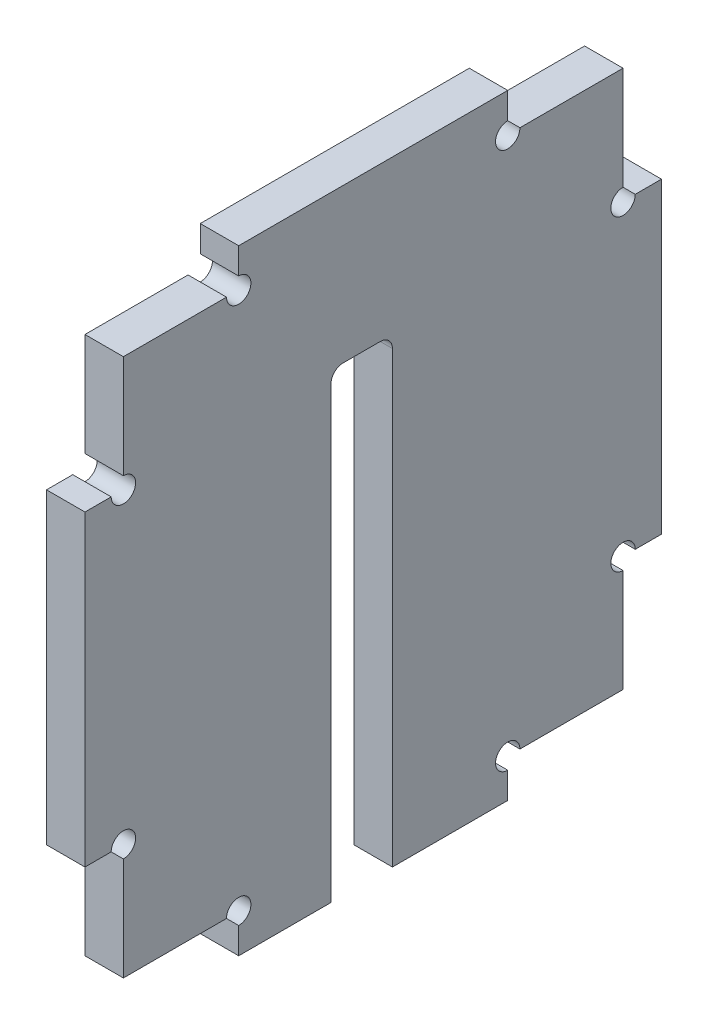
ISO-10303-21;
HEADER;
FILE_DESCRIPTION(('STEP AP214'),'2;1');
FILE_NAME('part.step','',(''),(''),'','','');
FILE_SCHEMA(('AUTOMOTIVE_DESIGN { 1 0 10303 214 1 1 1 1 }'));
ENDSEC;
DATA;
#1=APPLICATION_CONTEXT('core data for automotive mechanical design processes');
#2=APPLICATION_PROTOCOL_DEFINITION('international standard','automotive_design',2000,#1);
#3=PRODUCT_CONTEXT('',#1,'mechanical');
#4=PRODUCT('Part','Part','',(#3));
#5=PRODUCT_RELATED_PRODUCT_CATEGORY('part','',(#4));
#6=PRODUCT_DEFINITION_FORMATION('','',#4);
#7=PRODUCT_DEFINITION_CONTEXT('part definition',#1,'design');
#8=PRODUCT_DEFINITION('design','',#6,#7);
#9=PRODUCT_DEFINITION_SHAPE('','',#8);
#10=(LENGTH_UNIT() NAMED_UNIT(*) SI_UNIT(.MILLI.,.METRE.));
#11=(NAMED_UNIT(*) PLANE_ANGLE_UNIT() SI_UNIT($,.RADIAN.));
#12=(NAMED_UNIT(*) SI_UNIT($,.STERADIAN.) SOLID_ANGLE_UNIT());
#13=UNCERTAINTY_MEASURE_WITH_UNIT(LENGTH_MEASURE(1.E-05),#10,'distance_accuracy_value','');
#14=(GEOMETRIC_REPRESENTATION_CONTEXT(3) GLOBAL_UNCERTAINTY_ASSIGNED_CONTEXT((#13)) GLOBAL_UNIT_ASSIGNED_CONTEXT((#10,
#11,#12)) REPRESENTATION_CONTEXT('',''));
#15=CARTESIAN_POINT('',(0.,0.,0.));
#16=DIRECTION('',(0.,0.,1.));
#17=DIRECTION('',(1.,0.,0.));
#18=AXIS2_PLACEMENT_3D('',#15,#16,#17);
#19=CARTESIAN_POINT('',(5.,-40.,37.5));
#20=DIRECTION('',(0.,1.,0.));
#21=DIRECTION('',(0.,0.,1.));
#22=AXIS2_PLACEMENT_3D('',#19,#20,#21);
#23=PLANE('',#22);
#24=DIRECTION('',(0.,0.,-1.));
#25=VECTOR('',#24,1.);
#26=CARTESIAN_POINT('',(0.,-40.,37.5));
#27=LINE('',#26,#25);
#28=CARTESIAN_POINT('',(0.,-40.,17.5));
#29=VERTEX_POINT('',#28);
#30=CARTESIAN_POINT('',(0.,-40.,5.49999999999999));
#31=VERTEX_POINT('',#30);
#32=EDGE_CURVE('E420',#29,#31,#27,.T.);
#33=ORIENTED_EDGE('',*,*,#32,.T.);
#34=DIRECTION('',(1.,0.,0.));
#35=VECTOR('',#34,1.);
#36=CARTESIAN_POINT('',(0.,-40.,5.49999999999999));
#37=LINE('',#36,#35);
#38=CARTESIAN_POINT('',(5.,-40.,5.49999999999999));
#39=VERTEX_POINT('',#38);
#40=EDGE_CURVE('E578',#31,#39,#37,.T.);
#41=ORIENTED_EDGE('',*,*,#40,.T.);
#42=DIRECTION('',(0.,0.,-1.));
#43=VECTOR('',#42,1.);
#44=CARTESIAN_POINT('',(5.,-40.,37.5));
#45=LINE('',#44,#43);
#46=CARTESIAN_POINT('',(5.,-40.,17.5));
#47=VERTEX_POINT('',#46);
#48=EDGE_CURVE('E428',#47,#39,#45,.T.);
#49=ORIENTED_EDGE('',*,*,#48,.F.);
#50=DIRECTION('',(1.,0.,0.));
#51=VECTOR('',#50,1.);
#52=CARTESIAN_POINT('',(0.,-40.,17.5));
#53=LINE('',#52,#51);
#54=EDGE_CURVE('E350',#29,#47,#53,.T.);
#55=ORIENTED_EDGE('',*,*,#54,.F.);
#56=EDGE_LOOP('',(#33,#41,#49,#55));
#57=FACE_BOUND('',#56,.T.);
#58=ADVANCED_FACE('F39',(#57),#23,.F.);
#59=CARTESIAN_POINT('',(5.,0.,0.));
#60=DIRECTION('',(-1.,0.,0.));
#61=DIRECTION('',(0.,0.,1.));
#62=AXIS2_PLACEMENT_3D('',#59,#60,#61);
#63=PLANE('',#62);
#64=DIRECTION('',(0.,-1.,0.));
#65=VECTOR('',#64,1.);
#66=CARTESIAN_POINT('',(5.,0.,32.5));
#67=LINE('',#66,#65);
#68=CARTESIAN_POINT('',(5.,35.,32.5));
#69=VERTEX_POINT('',#68);
#70=CARTESIAN_POINT('',(5.,21.5875,32.5));
#71=VERTEX_POINT('',#70);
#72=EDGE_CURVE('E404',#69,#71,#67,.T.);
#73=ORIENTED_EDGE('',*,*,#72,.T.);
#74=CARTESIAN_POINT('',(5.,20.,32.5));
#75=DIRECTION('',(1.,0.,0.));
#76=DIRECTION('',(0.,0.,-1.));
#77=AXIS2_PLACEMENT_3D('',#74,#75,#76);
#78=CIRCLE('',#77,1.5875);
#79=CARTESIAN_POINT('',(5.,20.,34.0875));
#80=VERTEX_POINT('',#79);
#81=EDGE_CURVE('E481',#80,#71,#78,.T.);
#82=ORIENTED_EDGE('',*,*,#81,.F.);
#83=DIRECTION('',(0.,0.,1.));
#84=VECTOR('',#83,1.);
#85=CARTESIAN_POINT('',(5.,20.,0.));
#86=LINE('',#85,#84);
#87=CARTESIAN_POINT('',(5.,20.,37.5));
#88=VERTEX_POINT('',#87);
#89=EDGE_CURVE('E394',#80,#88,#86,.T.);
#90=ORIENTED_EDGE('',*,*,#89,.T.);
#91=DIRECTION('',(0.,-1.,0.));
#92=VECTOR('',#91,1.);
#93=CARTESIAN_POINT('',(5.,-40.,37.5));
#94=LINE('',#93,#92);
#95=CARTESIAN_POINT('',(5.,-20.,37.5));
#96=VERTEX_POINT('',#95);
#97=EDGE_CURVE('E423',#88,#96,#94,.T.);
#98=ORIENTED_EDGE('',*,*,#97,.T.);
#99=DIRECTION('',(0.,0.,1.));
#100=VECTOR('',#99,1.);
#101=CARTESIAN_POINT('',(5.,-20.,0.));
#102=LINE('',#101,#100);
#103=CARTESIAN_POINT('',(5.,-20.,34.0875));
#104=VERTEX_POINT('',#103);
#105=EDGE_CURVE('E372',#104,#96,#102,.T.);
#106=ORIENTED_EDGE('',*,*,#105,.F.);
#107=CARTESIAN_POINT('',(5.,-20.,32.5));
#108=DIRECTION('',(1.,0.,0.));
#109=DIRECTION('',(0.,0.,-1.));
#110=AXIS2_PLACEMENT_3D('',#107,#108,#109);
#111=CIRCLE('',#110,1.5875);
#112=CARTESIAN_POINT('',(5.,-21.5875,32.5));
#113=VERTEX_POINT('',#112);
#114=EDGE_CURVE('E728',#113,#104,#111,.T.);
#115=ORIENTED_EDGE('',*,*,#114,.F.);
#116=DIRECTION('',(0.,1.,0.));
#117=VECTOR('',#116,1.);
#118=CARTESIAN_POINT('',(5.,0.,32.5));
#119=LINE('',#118,#117);
#120=CARTESIAN_POINT('',(5.,-35.,32.5));
#121=VERTEX_POINT('',#120);
#122=EDGE_CURVE('E368',#121,#113,#119,.T.);
#123=ORIENTED_EDGE('',*,*,#122,.F.);
#124=DIRECTION('',(0.,0.,1.));
#125=VECTOR('',#124,1.);
#126=CARTESIAN_POINT('',(5.,-35.,0.));
#127=LINE('',#126,#125);
#128=CARTESIAN_POINT('',(5.,-35.,19.0875));
#129=VERTEX_POINT('',#128);
#130=EDGE_CURVE('E365',#129,#121,#127,.T.);
#131=ORIENTED_EDGE('',*,*,#130,.F.);
#132=CARTESIAN_POINT('',(5.,-35.,17.5));
#133=DIRECTION('',(1.,0.,0.));
#134=DIRECTION('',(0.,0.,-1.));
#135=AXIS2_PLACEMENT_3D('',#132,#133,#134);
#136=CIRCLE('',#135,1.5875);
#137=CARTESIAN_POINT('',(5.,-36.5875,17.5));
#138=VERTEX_POINT('',#137);
#139=EDGE_CURVE('E723',#138,#129,#136,.T.);
#140=ORIENTED_EDGE('',*,*,#139,.F.);
#141=DIRECTION('',(0.,1.,0.));
#142=VECTOR('',#141,1.);
#143=CARTESIAN_POINT('',(5.,0.,17.5));
#144=LINE('',#143,#142);
#145=EDGE_CURVE('E355',#47,#138,#144,.T.);
#146=ORIENTED_EDGE('',*,*,#145,.F.);
#147=ORIENTED_EDGE('',*,*,#48,.T.);
#148=DIRECTION('',(0.,-1.,0.));
#149=VECTOR('',#148,1.);
#150=CARTESIAN_POINT('',(5.,-40.,5.49999999999999));
#151=LINE('',#150,#149);
#152=CARTESIAN_POINT('',(5.,18.4125,5.49999999999999));
#153=VERTEX_POINT('',#152);
#154=EDGE_CURVE('E544',#153,#39,#151,.T.);
#155=ORIENTED_EDGE('',*,*,#154,.F.);
#156=CARTESIAN_POINT('',(5.,18.4125,3.91249999999999));
#157=DIRECTION('',(1.,0.,0.));
#158=DIRECTION('',(0.,0.,-1.));
#159=AXIS2_PLACEMENT_3D('',#156,#157,#158);
#160=CIRCLE('',#159,1.5875);
#161=CARTESIAN_POINT('',(5.,20.,3.91249999999999));
#162=VERTEX_POINT('',#161);
#163=EDGE_CURVE('E572',#162,#153,#160,.T.);
#164=ORIENTED_EDGE('',*,*,#163,.F.);
#165=DIRECTION('',(0.,0.,1.));
#166=VECTOR('',#165,1.);
#167=CARTESIAN_POINT('',(5.,20.,3.91249999999999));
#168=LINE('',#167,#166);
#169=CARTESIAN_POINT('',(5.,20.,-0.912500000000009));
#170=VERTEX_POINT('',#169);
#171=EDGE_CURVE('E568',#170,#162,#168,.T.);
#172=ORIENTED_EDGE('',*,*,#171,.F.);
#173=CARTESIAN_POINT('',(5.,18.4125,-0.912500000000009));
#174=DIRECTION('',(1.,0.,0.));
#175=DIRECTION('',(0.,0.,1.));
#176=AXIS2_PLACEMENT_3D('',#173,#174,#175);
#177=CIRCLE('',#176,1.5875);
#178=CARTESIAN_POINT('',(5.,18.4125,-2.50000000000001));
#179=VERTEX_POINT('',#178);
#180=EDGE_CURVE('E564',#179,#170,#177,.T.);
#181=ORIENTED_EDGE('',*,*,#180,.F.);
#182=DIRECTION('',(0.,1.,0.));
#183=VECTOR('',#182,1.);
#184=CARTESIAN_POINT('',(5.,-40.,-2.50000000000001));
#185=LINE('',#184,#183);
#186=CARTESIAN_POINT('',(5.,-40.,-2.50000000000001));
#187=VERTEX_POINT('',#186);
#188=EDGE_CURVE('E538',#187,#179,#185,.T.);
#189=ORIENTED_EDGE('',*,*,#188,.F.);
#190=CARTESIAN_POINT('',(5.,-40.,-17.5));
#191=VERTEX_POINT('',#190);
#192=EDGE_CURVE('E427',#187,#191,#45,.T.);
#193=ORIENTED_EDGE('',*,*,#192,.T.);
#194=DIRECTION('',(0.,1.,0.));
#195=VECTOR('',#194,1.);
#196=CARTESIAN_POINT('',(5.,0.,-17.5));
#197=LINE('',#196,#195);
#198=CARTESIAN_POINT('',(5.,-36.5875,-17.5));
#199=VERTEX_POINT('',#198);
#200=EDGE_CURVE('E281',#191,#199,#197,.T.);
#201=ORIENTED_EDGE('',*,*,#200,.T.);
#202=CARTESIAN_POINT('',(5.,-35.,-17.5));
#203=DIRECTION('',(1.,0.,0.));
#204=DIRECTION('',(0.,0.,-1.));
#205=AXIS2_PLACEMENT_3D('',#202,#203,#204);
#206=CIRCLE('',#205,1.5875);
#207=CARTESIAN_POINT('',(5.,-35.,-19.0875));
#208=VERTEX_POINT('',#207);
#209=EDGE_CURVE('E262',#208,#199,#206,.T.);
#210=ORIENTED_EDGE('',*,*,#209,.F.);
#211=DIRECTION('',(0.,0.,-1.));
#212=VECTOR('',#211,1.);
#213=CARTESIAN_POINT('',(5.,-35.,0.));
#214=LINE('',#213,#212);
#215=CARTESIAN_POINT('',(5.,-35.,-32.5));
#216=VERTEX_POINT('',#215);
#217=EDGE_CURVE('E278',#208,#216,#214,.T.);
#218=ORIENTED_EDGE('',*,*,#217,.T.);
#219=DIRECTION('',(0.,1.,0.));
#220=VECTOR('',#219,1.);
#221=CARTESIAN_POINT('',(5.,0.,-32.5));
#222=LINE('',#221,#220);
#223=CARTESIAN_POINT('',(5.,-21.5875,-32.5));
#224=VERTEX_POINT('',#223);
#225=EDGE_CURVE('E291',#216,#224,#222,.T.);
#226=ORIENTED_EDGE('',*,*,#225,.T.);
#227=CARTESIAN_POINT('',(5.,-20.,-32.5));
#228=DIRECTION('',(1.,0.,0.));
#229=DIRECTION('',(0.,0.,-1.));
#230=AXIS2_PLACEMENT_3D('',#227,#228,#229);
#231=CIRCLE('',#230,1.5875);
#232=CARTESIAN_POINT('',(5.,-20.,-34.0875));
#233=VERTEX_POINT('',#232);
#234=EDGE_CURVE('E509',#233,#224,#231,.T.);
#235=ORIENTED_EDGE('',*,*,#234,.F.);
#236=DIRECTION('',(0.,0.,-1.));
#237=VECTOR('',#236,1.);
#238=CARTESIAN_POINT('',(5.,-20.,0.));
#239=LINE('',#238,#237);
#240=CARTESIAN_POINT('',(5.,-20.,-37.5));
#241=VERTEX_POINT('',#240);
#242=EDGE_CURVE('E297',#233,#241,#239,.T.);
#243=ORIENTED_EDGE('',*,*,#242,.T.);
#244=DIRECTION('',(0.,1.,0.));
#245=VECTOR('',#244,1.);
#246=CARTESIAN_POINT('',(5.,-40.,-37.5));
#247=LINE('',#246,#245);
#248=CARTESIAN_POINT('',(5.,20.,-37.5));
#249=VERTEX_POINT('',#248);
#250=EDGE_CURVE('E415',#241,#249,#247,.T.);
#251=ORIENTED_EDGE('',*,*,#250,.T.);
#252=DIRECTION('',(0.,0.,-1.));
#253=VECTOR('',#252,1.);
#254=CARTESIAN_POINT('',(5.,20.,0.));
#255=LINE('',#254,#253);
#256=CARTESIAN_POINT('',(5.,20.,-34.0875));
#257=VERTEX_POINT('',#256);
#258=EDGE_CURVE('E326',#257,#249,#255,.T.);
#259=ORIENTED_EDGE('',*,*,#258,.F.);
#260=CARTESIAN_POINT('',(5.,20.,-32.5));
#261=DIRECTION('',(1.,0.,0.));
#262=DIRECTION('',(0.,0.,-1.));
#263=AXIS2_PLACEMENT_3D('',#260,#261,#262);
#264=CIRCLE('',#263,1.5875);
#265=CARTESIAN_POINT('',(5.,21.5875,-32.5));
#266=VERTEX_POINT('',#265);
#267=EDGE_CURVE('E502',#266,#257,#264,.T.);
#268=ORIENTED_EDGE('',*,*,#267,.F.);
#269=DIRECTION('',(0.,-1.,0.));
#270=VECTOR('',#269,1.);
#271=CARTESIAN_POINT('',(5.,0.,-32.5));
#272=LINE('',#271,#270);
#273=CARTESIAN_POINT('',(5.,35.,-32.5));
#274=VERTEX_POINT('',#273);
#275=EDGE_CURVE('E332',#274,#266,#272,.T.);
#276=ORIENTED_EDGE('',*,*,#275,.F.);
#277=DIRECTION('',(0.,0.,-1.));
#278=VECTOR('',#277,1.);
#279=CARTESIAN_POINT('',(5.,35.,0.));
#280=LINE('',#279,#278);
#281=CARTESIAN_POINT('',(5.,35.,-19.0875));
#282=VERTEX_POINT('',#281);
#283=EDGE_CURVE('E329',#282,#274,#280,.T.);
#284=ORIENTED_EDGE('',*,*,#283,.F.);
#285=CARTESIAN_POINT('',(5.,35.,-17.5));
#286=DIRECTION('',(1.,0.,0.));
#287=DIRECTION('',(0.,0.,-1.));
#288=AXIS2_PLACEMENT_3D('',#285,#286,#287);
#289=CIRCLE('',#288,1.5875);
#290=CARTESIAN_POINT('',(5.,36.5875,-17.5));
#291=VERTEX_POINT('',#290);
#292=EDGE_CURVE('E492',#291,#282,#289,.T.);
#293=ORIENTED_EDGE('',*,*,#292,.F.);
#294=DIRECTION('',(0.,-1.,0.));
#295=VECTOR('',#294,1.);
#296=CARTESIAN_POINT('',(5.,0.,-17.5));
#297=LINE('',#296,#295);
#298=CARTESIAN_POINT('',(5.,40.,-17.5));
#299=VERTEX_POINT('',#298);
#300=EDGE_CURVE('E316',#299,#291,#297,.T.);
#301=ORIENTED_EDGE('',*,*,#300,.F.);
#302=DIRECTION('',(0.,0.,1.));
#303=VECTOR('',#302,1.);
#304=CARTESIAN_POINT('',(5.,40.,37.5));
#305=LINE('',#304,#303);
#306=CARTESIAN_POINT('',(5.,40.,17.5));
#307=VERTEX_POINT('',#306);
#308=EDGE_CURVE('E419',#299,#307,#305,.T.);
#309=ORIENTED_EDGE('',*,*,#308,.T.);
#310=DIRECTION('',(0.,-1.,0.));
#311=VECTOR('',#310,1.);
#312=CARTESIAN_POINT('',(5.,0.,17.5));
#313=LINE('',#312,#311);
#314=CARTESIAN_POINT('',(5.,36.5875,17.5));
#315=VERTEX_POINT('',#314);
#316=EDGE_CURVE('E410',#307,#315,#313,.T.);
#317=ORIENTED_EDGE('',*,*,#316,.T.);
#318=CARTESIAN_POINT('',(5.,35.,17.5));
#319=DIRECTION('',(1.,0.,0.));
#320=DIRECTION('',(0.,0.,-1.));
#321=AXIS2_PLACEMENT_3D('',#318,#319,#320);
#322=CIRCLE('',#321,1.5875);
#323=CARTESIAN_POINT('',(5.,35.,19.0875));
#324=VERTEX_POINT('',#323);
#325=EDGE_CURVE('E489',#324,#315,#322,.T.);
#326=ORIENTED_EDGE('',*,*,#325,.F.);
#327=DIRECTION('',(0.,0.,1.));
#328=VECTOR('',#327,1.);
#329=CARTESIAN_POINT('',(5.,35.,0.));
#330=LINE('',#329,#328);
#331=EDGE_CURVE('E407',#324,#69,#330,.T.);
#332=ORIENTED_EDGE('',*,*,#331,.T.);
#333=EDGE_LOOP('',(#73,#82,#90,#98,#106,#115,#123,#131,#140,#146,#147,#155,#164,#172,#181,#189,
#193,#201,#210,#218,#226,#235,#243,#251,#259,#268,#276,#284,#293,#301,#309,#317,#326,#332));
#334=FACE_BOUND('',#333,.T.);
#335=ADVANCED_FACE('F276',(#334),#63,.F.);
#336=CARTESIAN_POINT('',(0.,0.,0.));
#337=DIRECTION('',(-1.,0.,0.));
#338=DIRECTION('',(0.,0.,1.));
#339=AXIS2_PLACEMENT_3D('',#336,#337,#338);
#340=PLANE('',#339);
#341=CARTESIAN_POINT('',(0.,20.,32.5));
#342=DIRECTION('',(1.,0.,0.));
#343=DIRECTION('',(0.,0.,-1.));
#344=AXIS2_PLACEMENT_3D('',#341,#342,#343);
#345=CIRCLE('',#344,1.5875);
#346=CARTESIAN_POINT('',(0.,20.,34.0875));
#347=VERTEX_POINT('',#346);
#348=CARTESIAN_POINT('',(0.,21.5875,32.5));
#349=VERTEX_POINT('',#348);
#350=EDGE_CURVE('E62',#347,#349,#345,.T.);
#351=ORIENTED_EDGE('',*,*,#350,.T.);
#352=DIRECTION('',(0.,1.,0.));
#353=VECTOR('',#352,1.);
#354=CARTESIAN_POINT('',(0.,20.,32.5));
#355=LINE('',#354,#353);
#356=CARTESIAN_POINT('',(0.,35.,32.5));
#357=VERTEX_POINT('',#356);
#358=EDGE_CURVE('E379',#349,#357,#355,.T.);
#359=ORIENTED_EDGE('',*,*,#358,.T.);
#360=DIRECTION('',(0.,0.,-1.));
#361=VECTOR('',#360,1.);
#362=CARTESIAN_POINT('',(0.,35.,32.5));
#363=LINE('',#362,#361);
#364=CARTESIAN_POINT('',(0.,35.,19.0875));
#365=VERTEX_POINT('',#364);
#366=EDGE_CURVE('E382',#357,#365,#363,.T.);
#367=ORIENTED_EDGE('',*,*,#366,.T.);
#368=CARTESIAN_POINT('',(0.,35.,17.5));
#369=DIRECTION('',(1.,0.,0.));
#370=DIRECTION('',(0.,0.,-1.));
#371=AXIS2_PLACEMENT_3D('',#368,#369,#370);
#372=CIRCLE('',#371,1.5875);
#373=CARTESIAN_POINT('',(0.,36.5875,17.5));
#374=VERTEX_POINT('',#373);
#375=EDGE_CURVE('E55',#365,#374,#372,.T.);
#376=ORIENTED_EDGE('',*,*,#375,.T.);
#377=DIRECTION('',(0.,1.,0.));
#378=VECTOR('',#377,1.);
#379=CARTESIAN_POINT('',(0.,35.,17.5));
#380=LINE('',#379,#378);
#381=CARTESIAN_POINT('',(0.,40.,17.5));
#382=VERTEX_POINT('',#381);
#383=EDGE_CURVE('E386',#374,#382,#380,.T.);
#384=ORIENTED_EDGE('',*,*,#383,.T.);
#385=DIRECTION('',(0.,0.,1.));
#386=VECTOR('',#385,1.);
#387=CARTESIAN_POINT('',(0.,40.,37.5));
#388=LINE('',#387,#386);
#389=CARTESIAN_POINT('',(0.,40.,-17.5));
#390=VERTEX_POINT('',#389);
#391=EDGE_CURVE('E435',#390,#382,#388,.T.);
#392=ORIENTED_EDGE('',*,*,#391,.F.);
#393=DIRECTION('',(0.,1.,0.));
#394=VECTOR('',#393,1.);
#395=CARTESIAN_POINT('',(0.,35.,-17.5));
#396=LINE('',#395,#394);
#397=CARTESIAN_POINT('',(0.,36.5875,-17.5));
#398=VERTEX_POINT('',#397);
#399=EDGE_CURVE('E290',#398,#390,#396,.T.);
#400=ORIENTED_EDGE('',*,*,#399,.F.);
#401=CARTESIAN_POINT('',(0.,35.,-17.5));
#402=DIRECTION('',(1.,0.,0.));
#403=DIRECTION('',(0.,0.,-1.));
#404=AXIS2_PLACEMENT_3D('',#401,#402,#403);
#405=CIRCLE('',#404,1.5875);
#406=CARTESIAN_POINT('',(0.,35.,-19.0875));
#407=VERTEX_POINT('',#406);
#408=EDGE_CURVE('E485',#398,#407,#405,.T.);
#409=ORIENTED_EDGE('',*,*,#408,.T.);
#410=DIRECTION('',(0.,0.,1.));
#411=VECTOR('',#410,1.);
#412=CARTESIAN_POINT('',(0.,35.,-32.5));
#413=LINE('',#412,#411);
#414=CARTESIAN_POINT('',(0.,35.,-32.5));
#415=VERTEX_POINT('',#414);
#416=EDGE_CURVE('E295',#415,#407,#413,.T.);
#417=ORIENTED_EDGE('',*,*,#416,.F.);
#418=DIRECTION('',(0.,1.,0.));
#419=VECTOR('',#418,1.);
#420=CARTESIAN_POINT('',(0.,20.,-32.5));
#421=LINE('',#420,#419);
#422=CARTESIAN_POINT('',(0.,21.5875,-32.5));
#423=VERTEX_POINT('',#422);
#424=EDGE_CURVE('E304',#423,#415,#421,.T.);
#425=ORIENTED_EDGE('',*,*,#424,.F.);
#426=CARTESIAN_POINT('',(0.,20.,-32.5));
#427=DIRECTION('',(1.,0.,0.));
#428=DIRECTION('',(0.,0.,-1.));
#429=AXIS2_PLACEMENT_3D('',#426,#427,#428);
#430=CIRCLE('',#429,1.5875);
#431=CARTESIAN_POINT('',(0.,20.,-34.0875));
#432=VERTEX_POINT('',#431);
#433=EDGE_CURVE('E498',#423,#432,#430,.T.);
#434=ORIENTED_EDGE('',*,*,#433,.T.);
#435=DIRECTION('',(0.,0.,1.));
#436=VECTOR('',#435,1.);
#437=CARTESIAN_POINT('',(0.,20.,-37.5));
#438=LINE('',#437,#436);
#439=CARTESIAN_POINT('',(0.,20.,-37.5));
#440=VERTEX_POINT('',#439);
#441=EDGE_CURVE('E307',#440,#432,#438,.T.);
#442=ORIENTED_EDGE('',*,*,#441,.F.);
#443=DIRECTION('',(0.,1.,0.));
#444=VECTOR('',#443,1.);
#445=CARTESIAN_POINT('',(0.,-40.,-37.5));
#446=LINE('',#445,#444);
#447=CARTESIAN_POINT('',(0.,-20.,-37.5));
#448=VERTEX_POINT('',#447);
#449=EDGE_CURVE('E414',#448,#440,#446,.T.);
#450=ORIENTED_EDGE('',*,*,#449,.F.);
#451=DIRECTION('',(0.,0.,1.));
#452=VECTOR('',#451,1.);
#453=CARTESIAN_POINT('',(0.,-20.,-37.5));
#454=LINE('',#453,#452);
#455=CARTESIAN_POINT('',(0.,-20.,-34.0875));
#456=VERTEX_POINT('',#455);
#457=EDGE_CURVE('E582',#448,#456,#454,.T.);
#458=ORIENTED_EDGE('',*,*,#457,.T.);
#459=CARTESIAN_POINT('',(0.,-20.,-32.5));
#460=DIRECTION('',(1.,0.,0.));
#461=DIRECTION('',(0.,0.,-1.));
#462=AXIS2_PLACEMENT_3D('',#459,#460,#461);
#463=CIRCLE('',#462,1.5875);
#464=CARTESIAN_POINT('',(0.,-21.5875,-32.5));
#465=VERTEX_POINT('',#464);
#466=EDGE_CURVE('E505',#456,#465,#463,.T.);
#467=ORIENTED_EDGE('',*,*,#466,.T.);
#468=DIRECTION('',(0.,-1.,0.));
#469=VECTOR('',#468,1.);
#470=CARTESIAN_POINT('',(0.,-20.,-32.5));
#471=LINE('',#470,#469);
#472=CARTESIAN_POINT('',(0.,-35.,-32.5));
#473=VERTEX_POINT('',#472);
#474=EDGE_CURVE('E600',#465,#473,#471,.T.);
#475=ORIENTED_EDGE('',*,*,#474,.T.);
#476=DIRECTION('',(0.,0.,1.));
#477=VECTOR('',#476,1.);
#478=CARTESIAN_POINT('',(0.,-35.,-32.5));
#479=LINE('',#478,#477);
#480=CARTESIAN_POINT('',(0.,-35.,-19.0875));
#481=VERTEX_POINT('',#480);
#482=EDGE_CURVE('E603',#473,#481,#479,.T.);
#483=ORIENTED_EDGE('',*,*,#482,.T.);
#484=CARTESIAN_POINT('',(0.,-35.,-17.5));
#485=DIRECTION('',(1.,0.,0.));
#486=DIRECTION('',(0.,0.,-1.));
#487=AXIS2_PLACEMENT_3D('',#484,#485,#486);
#488=CIRCLE('',#487,1.5875);
#489=CARTESIAN_POINT('',(0.,-36.5875,-17.5));
#490=VERTEX_POINT('',#489);
#491=EDGE_CURVE('E265',#481,#490,#488,.T.);
#492=ORIENTED_EDGE('',*,*,#491,.T.);
#493=DIRECTION('',(0.,-1.,0.));
#494=VECTOR('',#493,1.);
#495=CARTESIAN_POINT('',(0.,-35.,-17.5));
#496=LINE('',#495,#494);
#497=CARTESIAN_POINT('',(0.,-40.,-17.5));
#498=VERTEX_POINT('',#497);
#499=EDGE_CURVE('E606',#490,#498,#496,.T.);
#500=ORIENTED_EDGE('',*,*,#499,.T.);
#501=CARTESIAN_POINT('',(0.,-40.,-2.50000000000001));
#502=VERTEX_POINT('',#501);
#503=EDGE_CURVE('E443',#502,#498,#27,.T.);
#504=ORIENTED_EDGE('',*,*,#503,.F.);
#505=DIRECTION('',(0.,1.,0.));
#506=VECTOR('',#505,1.);
#507=CARTESIAN_POINT('',(0.,-40.,-2.50000000000001));
#508=LINE('',#507,#506);
#509=CARTESIAN_POINT('',(0.,18.4125,-2.50000000000001));
#510=VERTEX_POINT('',#509);
#511=EDGE_CURVE('E539',#502,#510,#508,.T.);
#512=ORIENTED_EDGE('',*,*,#511,.T.);
#513=CARTESIAN_POINT('',(0.,18.4125,-0.912500000000009));
#514=DIRECTION('',(1.,0.,0.));
#515=DIRECTION('',(0.,0.,1.));
#516=AXIS2_PLACEMENT_3D('',#513,#514,#515);
#517=CIRCLE('',#516,1.5875);
#518=CARTESIAN_POINT('',(0.,20.,-0.912500000000009));
#519=VERTEX_POINT('',#518);
#520=EDGE_CURVE('E543',#510,#519,#517,.T.);
#521=ORIENTED_EDGE('',*,*,#520,.T.);
#522=DIRECTION('',(0.,0.,1.));
#523=VECTOR('',#522,1.);
#524=CARTESIAN_POINT('',(0.,20.,3.91249999999999));
#525=LINE('',#524,#523);
#526=CARTESIAN_POINT('',(0.,20.,3.91249999999999));
#527=VERTEX_POINT('',#526);
#528=EDGE_CURVE('E548',#519,#527,#525,.T.);
#529=ORIENTED_EDGE('',*,*,#528,.T.);
#530=CARTESIAN_POINT('',(0.,18.4125,3.91249999999999));
#531=DIRECTION('',(1.,0.,0.));
#532=DIRECTION('',(0.,0.,-1.));
#533=AXIS2_PLACEMENT_3D('',#530,#531,#532);
#534=CIRCLE('',#533,1.5875);
#535=CARTESIAN_POINT('',(0.,18.4125,5.49999999999999));
#536=VERTEX_POINT('',#535);
#537=EDGE_CURVE('E552',#527,#536,#534,.T.);
#538=ORIENTED_EDGE('',*,*,#537,.T.);
#539=DIRECTION('',(0.,-1.,0.));
#540=VECTOR('',#539,1.);
#541=CARTESIAN_POINT('',(0.,-40.,5.49999999999999));
#542=LINE('',#541,#540);
#543=EDGE_CURVE('E556',#536,#31,#542,.T.);
#544=ORIENTED_EDGE('',*,*,#543,.T.);
#545=ORIENTED_EDGE('',*,*,#32,.F.);
#546=DIRECTION('',(0.,-1.,0.));
#547=VECTOR('',#546,1.);
#548=CARTESIAN_POINT('',(0.,-35.,17.5));
#549=LINE('',#548,#547);
#550=CARTESIAN_POINT('',(0.,-36.5875,17.5));
#551=VERTEX_POINT('',#550);
#552=EDGE_CURVE('E336',#551,#29,#549,.T.);
#553=ORIENTED_EDGE('',*,*,#552,.F.);
#554=CARTESIAN_POINT('',(0.,-35.,17.5));
#555=DIRECTION('',(1.,0.,0.));
#556=DIRECTION('',(0.,0.,-1.));
#557=AXIS2_PLACEMENT_3D('',#554,#555,#556);
#558=CIRCLE('',#557,1.5875);
#559=CARTESIAN_POINT('',(0.,-35.,19.0875));
#560=VERTEX_POINT('',#559);
#561=EDGE_CURVE('E283',#551,#560,#558,.T.);
#562=ORIENTED_EDGE('',*,*,#561,.T.);
#563=DIRECTION('',(0.,0.,-1.));
#564=VECTOR('',#563,1.);
#565=CARTESIAN_POINT('',(0.,-35.,32.5));
#566=LINE('',#565,#564);
#567=CARTESIAN_POINT('',(0.,-35.,32.5));
#568=VERTEX_POINT('',#567);
#569=EDGE_CURVE('E339',#568,#560,#566,.T.);
#570=ORIENTED_EDGE('',*,*,#569,.F.);
#571=DIRECTION('',(0.,-1.,0.));
#572=VECTOR('',#571,1.);
#573=CARTESIAN_POINT('',(0.,-20.,32.5));
#574=LINE('',#573,#572);
#575=CARTESIAN_POINT('',(0.,-21.5875,32.5));
#576=VERTEX_POINT('',#575);
#577=EDGE_CURVE('E343',#576,#568,#574,.T.);
#578=ORIENTED_EDGE('',*,*,#577,.F.);
#579=CARTESIAN_POINT('',(0.,-20.,32.5));
#580=DIRECTION('',(1.,0.,0.));
#581=DIRECTION('',(0.,0.,-1.));
#582=AXIS2_PLACEMENT_3D('',#579,#580,#581);
#583=CIRCLE('',#582,1.5875);
#584=CARTESIAN_POINT('',(0.,-20.,34.0875));
#585=VERTEX_POINT('',#584);
#586=EDGE_CURVE('E726',#576,#585,#583,.T.);
#587=ORIENTED_EDGE('',*,*,#586,.T.);
#588=DIRECTION('',(0.,0.,-1.));
#589=VECTOR('',#588,1.);
#590=CARTESIAN_POINT('',(0.,-20.,37.5));
#591=LINE('',#590,#589);
#592=CARTESIAN_POINT('',(0.,-20.,37.5));
#593=VERTEX_POINT('',#592);
#594=EDGE_CURVE('E346',#593,#585,#591,.T.);
#595=ORIENTED_EDGE('',*,*,#594,.F.);
#596=DIRECTION('',(0.,-1.,0.));
#597=VECTOR('',#596,1.);
#598=CARTESIAN_POINT('',(0.,-40.,37.5));
#599=LINE('',#598,#597);
#600=CARTESIAN_POINT('',(0.,20.,37.5));
#601=VERTEX_POINT('',#600);
#602=EDGE_CURVE('E439',#601,#593,#599,.T.);
#603=ORIENTED_EDGE('',*,*,#602,.F.);
#604=DIRECTION('',(0.,0.,-1.));
#605=VECTOR('',#604,1.);
#606=CARTESIAN_POINT('',(0.,20.,37.5));
#607=LINE('',#606,#605);
#608=EDGE_CURVE('E375',#601,#347,#607,.T.);
#609=ORIENTED_EDGE('',*,*,#608,.T.);
#610=EDGE_LOOP('',(#351,#359,#367,#376,#384,#392,#400,#409,#417,#425,#434,#442,#450,#458,#467,
#475,#483,#492,#500,#504,#512,#521,#529,#538,#544,#545,#553,#562,#570,#578,#587,#595,#603,#609));
#611=FACE_BOUND('',#610,.T.);
#612=ADVANCED_FACE('F472',(#611),#340,.T.);
#613=CARTESIAN_POINT('',(5.,-40.,-37.5));
#614=DIRECTION('',(0.,0.,1.));
#615=DIRECTION('',(1.,0.,0.));
#616=AXIS2_PLACEMENT_3D('',#613,#614,#615);
#617=PLANE('',#616);
#618=ORIENTED_EDGE('',*,*,#250,.F.);
#619=DIRECTION('',(1.,0.,0.));
#620=VECTOR('',#619,1.);
#621=CARTESIAN_POINT('',(0.,-20.,-37.5));
#622=LINE('',#621,#620);
#623=EDGE_CURVE('E609',#448,#241,#622,.T.);
#624=ORIENTED_EDGE('',*,*,#623,.F.);
#625=ORIENTED_EDGE('',*,*,#449,.T.);
#626=DIRECTION('',(1.,0.,0.));
#627=VECTOR('',#626,1.);
#628=CARTESIAN_POINT('',(0.,20.,-37.5));
#629=LINE('',#628,#627);
#630=EDGE_CURVE('E312',#440,#249,#629,.T.);
#631=ORIENTED_EDGE('',*,*,#630,.T.);
#632=EDGE_LOOP('',(#618,#624,#625,#631));
#633=FACE_BOUND('',#632,.T.);
#634=ADVANCED_FACE('F41',(#633),#617,.F.);
#635=CARTESIAN_POINT('',(5.,40.,37.5));
#636=DIRECTION('',(0.,-1.,0.));
#637=DIRECTION('',(0.,0.,-1.));
#638=AXIS2_PLACEMENT_3D('',#635,#636,#637);
#639=PLANE('',#638);
#640=DIRECTION('',(1.,0.,0.));
#641=VECTOR('',#640,1.);
#642=CARTESIAN_POINT('',(0.,40.,-17.5));
#643=LINE('',#642,#641);
#644=EDGE_CURVE('E311',#390,#299,#643,.T.);
#645=ORIENTED_EDGE('',*,*,#644,.F.);
#646=ORIENTED_EDGE('',*,*,#391,.T.);
#647=DIRECTION('',(1.,0.,0.));
#648=VECTOR('',#647,1.);
#649=CARTESIAN_POINT('',(0.,40.,17.5));
#650=LINE('',#649,#648);
#651=EDGE_CURVE('E390',#382,#307,#650,.T.);
#652=ORIENTED_EDGE('',*,*,#651,.T.);
#653=ORIENTED_EDGE('',*,*,#308,.F.);
#654=EDGE_LOOP('',(#645,#646,#652,#653));
#655=FACE_BOUND('',#654,.T.);
#656=ADVANCED_FACE('F661',(#655),#639,.F.);
#657=CARTESIAN_POINT('',(5.,-40.,37.5));
#658=DIRECTION('',(0.,0.,-1.));
#659=DIRECTION('',(-1.,0.,0.));
#660=AXIS2_PLACEMENT_3D('',#657,#658,#659);
#661=PLANE('',#660);
#662=DIRECTION('',(1.,0.,0.));
#663=VECTOR('',#662,1.);
#664=CARTESIAN_POINT('',(0.,-20.,37.5));
#665=LINE('',#664,#663);
#666=EDGE_CURVE('E351',#593,#96,#665,.T.);
#667=ORIENTED_EDGE('',*,*,#666,.T.);
#668=ORIENTED_EDGE('',*,*,#97,.F.);
#669=DIRECTION('',(1.,0.,0.));
#670=VECTOR('',#669,1.);
#671=CARTESIAN_POINT('',(0.,20.,37.5));
#672=LINE('',#671,#670);
#673=EDGE_CURVE('E389',#601,#88,#672,.T.);
#674=ORIENTED_EDGE('',*,*,#673,.F.);
#675=ORIENTED_EDGE('',*,*,#602,.T.);
#676=EDGE_LOOP('',(#667,#668,#674,#675));
#677=FACE_BOUND('',#676,.T.);
#678=ADVANCED_FACE('F477',(#677),#661,.F.);
#679=ORIENTED_EDGE('',*,*,#192,.F.);
#680=DIRECTION('',(1.,0.,0.));
#681=VECTOR('',#680,1.);
#682=CARTESIAN_POINT('',(0.,-40.,-2.50000000000001));
#683=LINE('',#682,#681);
#684=EDGE_CURVE('E560',#502,#187,#683,.T.);
#685=ORIENTED_EDGE('',*,*,#684,.F.);
#686=ORIENTED_EDGE('',*,*,#503,.T.);
#687=DIRECTION('',(1.,0.,0.));
#688=VECTOR('',#687,1.);
#689=CARTESIAN_POINT('',(0.,-40.,-17.5));
#690=LINE('',#689,#688);
#691=EDGE_CURVE('E610',#498,#191,#690,.T.);
#692=ORIENTED_EDGE('',*,*,#691,.T.);
#693=EDGE_LOOP('',(#679,#685,#686,#692));
#694=FACE_BOUND('',#693,.T.);
#695=ADVANCED_FACE('F692',(#694),#23,.F.);
#696=CARTESIAN_POINT('',(0.,35.,17.5));
#697=DIRECTION('',(0.,0.,-1.));
#698=DIRECTION('',(-1.,0.,0.));
#699=AXIS2_PLACEMENT_3D('',#696,#697,#698);
#700=PLANE('',#699);
#701=ORIENTED_EDGE('',*,*,#383,.F.);
#702=DIRECTION('',(1.,0.,0.));
#703=VECTOR('',#702,1.);
#704=CARTESIAN_POINT('',(0.,36.5875,17.5));
#705=LINE('',#704,#703);
#706=EDGE_CURVE('E534',#374,#315,#705,.T.);
#707=ORIENTED_EDGE('',*,*,#706,.T.);
#708=ORIENTED_EDGE('',*,*,#316,.F.);
#709=ORIENTED_EDGE('',*,*,#651,.F.);
#710=EDGE_LOOP('',(#701,#707,#708,#709));
#711=FACE_BOUND('',#710,.T.);
#712=ADVANCED_FACE('F667',(#711),#700,.F.);
#713=CARTESIAN_POINT('',(0.,35.,32.5));
#714=DIRECTION('',(0.,-1.,0.));
#715=DIRECTION('',(0.,0.,-1.));
#716=AXIS2_PLACEMENT_3D('',#713,#714,#715);
#717=PLANE('',#716);
#718=ORIENTED_EDGE('',*,*,#331,.F.);
#719=DIRECTION('',(1.,0.,0.));
#720=VECTOR('',#719,1.);
#721=CARTESIAN_POINT('',(0.,35.,19.0875));
#722=LINE('',#721,#720);
#723=EDGE_CURVE('E11',#324,#365,#722,.F.);
#724=ORIENTED_EDGE('',*,*,#723,.T.);
#725=ORIENTED_EDGE('',*,*,#366,.F.);
#726=DIRECTION('',(1.,0.,0.));
#727=VECTOR('',#726,1.);
#728=CARTESIAN_POINT('',(0.,35.,32.5));
#729=LINE('',#728,#727);
#730=EDGE_CURVE('E395',#357,#69,#729,.T.);
#731=ORIENTED_EDGE('',*,*,#730,.T.);
#732=EDGE_LOOP('',(#718,#724,#725,#731));
#733=FACE_BOUND('',#732,.T.);
#734=ADVANCED_FACE('F673',(#733),#717,.F.);
#735=CARTESIAN_POINT('',(0.,20.,32.5));
#736=DIRECTION('',(0.,0.,-1.));
#737=DIRECTION('',(-1.,0.,0.));
#738=AXIS2_PLACEMENT_3D('',#735,#736,#737);
#739=PLANE('',#738);
#740=ORIENTED_EDGE('',*,*,#358,.F.);
#741=DIRECTION('',(1.,0.,0.));
#742=VECTOR('',#741,1.);
#743=CARTESIAN_POINT('',(0.,21.5875,32.5));
#744=LINE('',#743,#742);
#745=EDGE_CURVE('E531',#349,#71,#744,.T.);
#746=ORIENTED_EDGE('',*,*,#745,.T.);
#747=ORIENTED_EDGE('',*,*,#72,.F.);
#748=ORIENTED_EDGE('',*,*,#730,.F.);
#749=EDGE_LOOP('',(#740,#746,#747,#748));
#750=FACE_BOUND('',#749,.T.);
#751=ADVANCED_FACE('F675',(#750),#739,.F.);
#752=CARTESIAN_POINT('',(0.,20.,37.5));
#753=DIRECTION('',(0.,-1.,0.));
#754=DIRECTION('',(0.,0.,-1.));
#755=AXIS2_PLACEMENT_3D('',#752,#753,#754);
#756=PLANE('',#755);
#757=ORIENTED_EDGE('',*,*,#89,.F.);
#758=DIRECTION('',(1.,0.,0.));
#759=VECTOR('',#758,1.);
#760=CARTESIAN_POINT('',(0.,20.,34.0875));
#761=LINE('',#760,#759);
#762=EDGE_CURVE('E48',#80,#347,#761,.F.);
#763=ORIENTED_EDGE('',*,*,#762,.T.);
#764=ORIENTED_EDGE('',*,*,#608,.F.);
#765=ORIENTED_EDGE('',*,*,#673,.T.);
#766=EDGE_LOOP('',(#757,#763,#764,#765));
#767=FACE_BOUND('',#766,.T.);
#768=ADVANCED_FACE('F467',(#767),#756,.F.);
#769=CARTESIAN_POINT('',(0.,-20.,37.5));
#770=DIRECTION('',(0.,-1.,0.));
#771=DIRECTION('',(0.,0.,-1.));
#772=AXIS2_PLACEMENT_3D('',#769,#770,#771);
#773=PLANE('',#772);
#774=DIRECTION('',(1.,0.,0.));
#775=VECTOR('',#774,1.);
#776=CARTESIAN_POINT('',(0.,-20.,34.0875));
#777=LINE('',#776,#775);
#778=EDGE_CURVE('E528',#104,#585,#777,.F.);
#779=ORIENTED_EDGE('',*,*,#778,.F.);
#780=ORIENTED_EDGE('',*,*,#105,.T.);
#781=ORIENTED_EDGE('',*,*,#666,.F.);
#782=ORIENTED_EDGE('',*,*,#594,.T.);
#783=EDGE_LOOP('',(#779,#780,#781,#782));
#784=FACE_BOUND('',#783,.T.);
#785=ADVANCED_FACE('F734',(#784),#773,.T.);
#786=CARTESIAN_POINT('',(0.,-20.,32.5));
#787=DIRECTION('',(0.,0.,1.));
#788=DIRECTION('',(1.,0.,0.));
#789=AXIS2_PLACEMENT_3D('',#786,#787,#788);
#790=PLANE('',#789);
#791=DIRECTION('',(1.,0.,0.));
#792=VECTOR('',#791,1.);
#793=CARTESIAN_POINT('',(0.,-21.5875,32.5));
#794=LINE('',#793,#792);
#795=EDGE_CURVE('E462',#576,#113,#794,.T.);
#796=ORIENTED_EDGE('',*,*,#795,.F.);
#797=ORIENTED_EDGE('',*,*,#577,.T.);
#798=DIRECTION('',(1.,0.,0.));
#799=VECTOR('',#798,1.);
#800=CARTESIAN_POINT('',(0.,-35.,32.5));
#801=LINE('',#800,#799);
#802=EDGE_CURVE('E356',#568,#121,#801,.T.);
#803=ORIENTED_EDGE('',*,*,#802,.T.);
#804=ORIENTED_EDGE('',*,*,#122,.T.);
#805=EDGE_LOOP('',(#796,#797,#803,#804));
#806=FACE_BOUND('',#805,.T.);
#807=ADVANCED_FACE('F736',(#806),#790,.T.);
#808=CARTESIAN_POINT('',(0.,-35.,32.5));
#809=DIRECTION('',(0.,-1.,0.));
#810=DIRECTION('',(0.,0.,-1.));
#811=AXIS2_PLACEMENT_3D('',#808,#809,#810);
#812=PLANE('',#811);
#813=DIRECTION('',(1.,0.,0.));
#814=VECTOR('',#813,1.);
#815=CARTESIAN_POINT('',(0.,-35.,19.0875));
#816=LINE('',#815,#814);
#817=EDGE_CURVE('E525',#129,#560,#816,.F.);
#818=ORIENTED_EDGE('',*,*,#817,.F.);
#819=ORIENTED_EDGE('',*,*,#130,.T.);
#820=ORIENTED_EDGE('',*,*,#802,.F.);
#821=ORIENTED_EDGE('',*,*,#569,.T.);
#822=EDGE_LOOP('',(#818,#819,#820,#821));
#823=FACE_BOUND('',#822,.T.);
#824=ADVANCED_FACE('F742',(#823),#812,.T.);
#825=CARTESIAN_POINT('',(0.,-35.,17.5));
#826=DIRECTION('',(0.,0.,1.));
#827=DIRECTION('',(1.,0.,0.));
#828=AXIS2_PLACEMENT_3D('',#825,#826,#827);
#829=PLANE('',#828);
#830=DIRECTION('',(1.,0.,0.));
#831=VECTOR('',#830,1.);
#832=CARTESIAN_POINT('',(0.,-36.5875,17.5));
#833=LINE('',#832,#831);
#834=EDGE_CURVE('E459',#551,#138,#833,.T.);
#835=ORIENTED_EDGE('',*,*,#834,.F.);
#836=ORIENTED_EDGE('',*,*,#552,.T.);
#837=ORIENTED_EDGE('',*,*,#54,.T.);
#838=ORIENTED_EDGE('',*,*,#145,.T.);
#839=EDGE_LOOP('',(#835,#836,#837,#838));
#840=FACE_BOUND('',#839,.T.);
#841=ADVANCED_FACE('F751',(#840),#829,.T.);
#842=CARTESIAN_POINT('',(0.,20.,-32.5));
#843=DIRECTION('',(0.,0.,-1.));
#844=DIRECTION('',(-1.,0.,0.));
#845=AXIS2_PLACEMENT_3D('',#842,#843,#844);
#846=PLANE('',#845);
#847=DIRECTION('',(1.,0.,0.));
#848=VECTOR('',#847,1.);
#849=CARTESIAN_POINT('',(0.,21.5875,-32.5));
#850=LINE('',#849,#848);
#851=EDGE_CURVE('E522',#423,#266,#850,.T.);
#852=ORIENTED_EDGE('',*,*,#851,.F.);
#853=ORIENTED_EDGE('',*,*,#424,.T.);
#854=DIRECTION('',(1.,0.,0.));
#855=VECTOR('',#854,1.);
#856=CARTESIAN_POINT('',(0.,35.,-32.5));
#857=LINE('',#856,#855);
#858=EDGE_CURVE('E317',#415,#274,#857,.T.);
#859=ORIENTED_EDGE('',*,*,#858,.T.);
#860=ORIENTED_EDGE('',*,*,#275,.T.);
#861=EDGE_LOOP('',(#852,#853,#859,#860));
#862=FACE_BOUND('',#861,.T.);
#863=ADVANCED_FACE('F642',(#862),#846,.T.);
#864=CARTESIAN_POINT('',(0.,35.,-32.5));
#865=DIRECTION('',(0.,1.,0.));
#866=DIRECTION('',(0.,0.,1.));
#867=AXIS2_PLACEMENT_3D('',#864,#865,#866);
#868=PLANE('',#867);
#869=DIRECTION('',(1.,0.,0.));
#870=VECTOR('',#869,1.);
#871=CARTESIAN_POINT('',(0.,35.,-19.0875));
#872=LINE('',#871,#870);
#873=EDGE_CURVE('E519',#282,#407,#872,.F.);
#874=ORIENTED_EDGE('',*,*,#873,.F.);
#875=ORIENTED_EDGE('',*,*,#283,.T.);
#876=ORIENTED_EDGE('',*,*,#858,.F.);
#877=ORIENTED_EDGE('',*,*,#416,.T.);
#878=EDGE_LOOP('',(#874,#875,#876,#877));
#879=FACE_BOUND('',#878,.T.);
#880=ADVANCED_FACE('F650',(#879),#868,.T.);
#881=CARTESIAN_POINT('',(0.,20.,-37.5));
#882=DIRECTION('',(0.,1.,0.));
#883=DIRECTION('',(0.,0.,1.));
#884=AXIS2_PLACEMENT_3D('',#881,#882,#883);
#885=PLANE('',#884);
#886=DIRECTION('',(1.,0.,0.));
#887=VECTOR('',#886,1.);
#888=CARTESIAN_POINT('',(0.,20.,-34.0875));
#889=LINE('',#888,#887);
#890=EDGE_CURVE('E456',#257,#432,#889,.F.);
#891=ORIENTED_EDGE('',*,*,#890,.F.);
#892=ORIENTED_EDGE('',*,*,#258,.T.);
#893=ORIENTED_EDGE('',*,*,#630,.F.);
#894=ORIENTED_EDGE('',*,*,#441,.T.);
#895=EDGE_LOOP('',(#891,#892,#893,#894));
#896=FACE_BOUND('',#895,.T.);
#897=ADVANCED_FACE('F634',(#896),#885,.T.);
#898=CARTESIAN_POINT('',(0.,35.,-17.5));
#899=DIRECTION('',(0.,0.,-1.));
#900=DIRECTION('',(-1.,0.,0.));
#901=AXIS2_PLACEMENT_3D('',#898,#899,#900);
#902=PLANE('',#901);
#903=DIRECTION('',(1.,0.,0.));
#904=VECTOR('',#903,1.);
#905=CARTESIAN_POINT('',(0.,36.5875,-17.5));
#906=LINE('',#905,#904);
#907=EDGE_CURVE('E453',#398,#291,#906,.T.);
#908=ORIENTED_EDGE('',*,*,#907,.F.);
#909=ORIENTED_EDGE('',*,*,#399,.T.);
#910=ORIENTED_EDGE('',*,*,#644,.T.);
#911=ORIENTED_EDGE('',*,*,#300,.T.);
#912=EDGE_LOOP('',(#908,#909,#910,#911));
#913=FACE_BOUND('',#912,.T.);
#914=ADVANCED_FACE('F658',(#913),#902,.T.);
#915=CARTESIAN_POINT('',(0.,-35.,-32.5));
#916=DIRECTION('',(0.,1.,0.));
#917=DIRECTION('',(0.,0.,1.));
#918=AXIS2_PLACEMENT_3D('',#915,#916,#917);
#919=PLANE('',#918);
#920=ORIENTED_EDGE('',*,*,#217,.F.);
#921=DIRECTION('',(1.,0.,0.));
#922=VECTOR('',#921,1.);
#923=CARTESIAN_POINT('',(0.,-35.,-19.0875));
#924=LINE('',#923,#922);
#925=EDGE_CURVE('E259',#208,#481,#924,.F.);
#926=ORIENTED_EDGE('',*,*,#925,.T.);
#927=ORIENTED_EDGE('',*,*,#482,.F.);
#928=DIRECTION('',(1.,0.,0.));
#929=VECTOR('',#928,1.);
#930=CARTESIAN_POINT('',(0.,-35.,-32.5));
#931=LINE('',#930,#929);
#932=EDGE_CURVE('E288',#473,#216,#931,.T.);
#933=ORIENTED_EDGE('',*,*,#932,.T.);
#934=EDGE_LOOP('',(#920,#926,#927,#933));
#935=FACE_BOUND('',#934,.T.);
#936=ADVANCED_FACE('F286',(#935),#919,.F.);
#937=CARTESIAN_POINT('',(0.,-20.,-32.5));
#938=DIRECTION('',(0.,0.,1.));
#939=DIRECTION('',(1.,0.,0.));
#940=AXIS2_PLACEMENT_3D('',#937,#938,#939);
#941=PLANE('',#940);
#942=ORIENTED_EDGE('',*,*,#474,.F.);
#943=DIRECTION('',(1.,0.,0.));
#944=VECTOR('',#943,1.);
#945=CARTESIAN_POINT('',(0.,-21.5875,-32.5));
#946=LINE('',#945,#944);
#947=EDGE_CURVE('E271',#465,#224,#946,.T.);
#948=ORIENTED_EDGE('',*,*,#947,.T.);
#949=ORIENTED_EDGE('',*,*,#225,.F.);
#950=ORIENTED_EDGE('',*,*,#932,.F.);
#951=EDGE_LOOP('',(#942,#948,#949,#950));
#952=FACE_BOUND('',#951,.T.);
#953=ADVANCED_FACE('F930',(#952),#941,.F.);
#954=CARTESIAN_POINT('',(0.,-20.,-37.5));
#955=DIRECTION('',(0.,1.,0.));
#956=DIRECTION('',(0.,0.,1.));
#957=AXIS2_PLACEMENT_3D('',#954,#955,#956);
#958=PLANE('',#957);
#959=ORIENTED_EDGE('',*,*,#242,.F.);
#960=DIRECTION('',(1.,0.,0.));
#961=VECTOR('',#960,1.);
#962=CARTESIAN_POINT('',(0.,-20.,-34.0875));
#963=LINE('',#962,#961);
#964=EDGE_CURVE('E449',#233,#456,#963,.F.);
#965=ORIENTED_EDGE('',*,*,#964,.T.);
#966=ORIENTED_EDGE('',*,*,#457,.F.);
#967=ORIENTED_EDGE('',*,*,#623,.T.);
#968=EDGE_LOOP('',(#959,#965,#966,#967));
#969=FACE_BOUND('',#968,.T.);
#970=ADVANCED_FACE('F627',(#969),#958,.F.);
#971=CARTESIAN_POINT('',(0.,-35.,-17.5));
#972=DIRECTION('',(0.,0.,1.));
#973=DIRECTION('',(1.,0.,0.));
#974=AXIS2_PLACEMENT_3D('',#971,#972,#973);
#975=PLANE('',#974);
#976=ORIENTED_EDGE('',*,*,#499,.F.);
#977=DIRECTION('',(1.,0.,0.));
#978=VECTOR('',#977,1.);
#979=CARTESIAN_POINT('',(0.,-36.5875,-17.5));
#980=LINE('',#979,#978);
#981=EDGE_CURVE('E432',#490,#199,#980,.T.);
#982=ORIENTED_EDGE('',*,*,#981,.T.);
#983=ORIENTED_EDGE('',*,*,#200,.F.);
#984=ORIENTED_EDGE('',*,*,#691,.F.);
#985=EDGE_LOOP('',(#976,#982,#983,#984));
#986=FACE_BOUND('',#985,.T.);
#987=ADVANCED_FACE('F716',(#986),#975,.F.);
#988=CARTESIAN_POINT('',(0.,-40.,5.49999999999999));
#989=DIRECTION('',(0.,0.,1.));
#990=DIRECTION('',(0.,-1.,0.));
#991=AXIS2_PLACEMENT_3D('',#988,#989,#990);
#992=PLANE('',#991);
#993=ORIENTED_EDGE('',*,*,#154,.T.);
#994=ORIENTED_EDGE('',*,*,#40,.F.);
#995=ORIENTED_EDGE('',*,*,#543,.F.);
#996=DIRECTION('',(1.,0.,0.));
#997=VECTOR('',#996,1.);
#998=CARTESIAN_POINT('',(0.,18.4125,5.49999999999999));
#999=LINE('',#998,#997);
#1000=EDGE_CURVE('E583',#536,#153,#999,.T.);
#1001=ORIENTED_EDGE('',*,*,#1000,.T.);
#1002=EDGE_LOOP('',(#993,#994,#995,#1001));
#1003=FACE_BOUND('',#1002,.T.);
#1004=ADVANCED_FACE('F788',(#1003),#992,.F.);
#1005=CARTESIAN_POINT('',(0.,18.4125,3.91249999999999));
#1006=DIRECTION('',(1.,0.,0.));
#1007=DIRECTION('',(0.,0.,-1.));
#1008=AXIS2_PLACEMENT_3D('',#1005,#1006,#1007);
#1009=CYLINDRICAL_SURFACE('',#1008,1.5875);
#1010=ORIENTED_EDGE('',*,*,#163,.T.);
#1011=ORIENTED_EDGE('',*,*,#1000,.F.);
#1012=ORIENTED_EDGE('',*,*,#537,.F.);
#1013=DIRECTION('',(1.,0.,0.));
#1014=VECTOR('',#1013,1.);
#1015=CARTESIAN_POINT('',(0.,20.,3.91249999999999));
#1016=LINE('',#1015,#1014);
#1017=EDGE_CURVE('E586',#527,#162,#1016,.T.);
#1018=ORIENTED_EDGE('',*,*,#1017,.T.);
#1019=EDGE_LOOP('',(#1010,#1011,#1012,#1018));
#1020=FACE_BOUND('',#1019,.T.);
#1021=ADVANCED_FACE('F792',(#1020),#1009,.F.);
#1022=CARTESIAN_POINT('',(0.,20.,3.91249999999999));
#1023=DIRECTION('',(0.,1.,0.));
#1024=DIRECTION('',(0.,0.,1.));
#1025=AXIS2_PLACEMENT_3D('',#1022,#1023,#1024);
#1026=PLANE('',#1025);
#1027=ORIENTED_EDGE('',*,*,#171,.T.);
#1028=ORIENTED_EDGE('',*,*,#1017,.F.);
#1029=ORIENTED_EDGE('',*,*,#528,.F.);
#1030=DIRECTION('',(1.,0.,0.));
#1031=VECTOR('',#1030,1.);
#1032=CARTESIAN_POINT('',(0.,20.,-0.912500000000009));
#1033=LINE('',#1032,#1031);
#1034=EDGE_CURVE('E589',#519,#170,#1033,.T.);
#1035=ORIENTED_EDGE('',*,*,#1034,.T.);
#1036=EDGE_LOOP('',(#1027,#1028,#1029,#1035));
#1037=FACE_BOUND('',#1036,.T.);
#1038=ADVANCED_FACE('F803',(#1037),#1026,.F.);
#1039=CARTESIAN_POINT('',(0.,18.4125,-0.912500000000009));
#1040=DIRECTION('',(1.,0.,0.));
#1041=DIRECTION('',(0.,0.,-1.));
#1042=AXIS2_PLACEMENT_3D('',#1039,#1040,#1041);
#1043=CYLINDRICAL_SURFACE('',#1042,1.5875);
#1044=ORIENTED_EDGE('',*,*,#180,.T.);
#1045=ORIENTED_EDGE('',*,*,#1034,.F.);
#1046=ORIENTED_EDGE('',*,*,#520,.F.);
#1047=DIRECTION('',(1.,0.,0.));
#1048=VECTOR('',#1047,1.);
#1049=CARTESIAN_POINT('',(0.,18.4125,-2.50000000000001));
#1050=LINE('',#1049,#1048);
#1051=EDGE_CURVE('E592',#510,#179,#1050,.T.);
#1052=ORIENTED_EDGE('',*,*,#1051,.T.);
#1053=EDGE_LOOP('',(#1044,#1045,#1046,#1052));
#1054=FACE_BOUND('',#1053,.T.);
#1055=ADVANCED_FACE('F813',(#1054),#1043,.F.);
#1056=CARTESIAN_POINT('',(0.,-40.,-2.50000000000001));
#1057=DIRECTION('',(0.,0.,-1.));
#1058=DIRECTION('',(-1.,0.,0.));
#1059=AXIS2_PLACEMENT_3D('',#1056,#1057,#1058);
#1060=PLANE('',#1059);
#1061=ORIENTED_EDGE('',*,*,#188,.T.);
#1062=ORIENTED_EDGE('',*,*,#1051,.F.);
#1063=ORIENTED_EDGE('',*,*,#511,.F.);
#1064=ORIENTED_EDGE('',*,*,#684,.T.);
#1065=EDGE_LOOP('',(#1061,#1062,#1063,#1064));
#1066=FACE_BOUND('',#1065,.T.);
#1067=ADVANCED_FACE('F823',(#1066),#1060,.F.);
#1068=CARTESIAN_POINT('',(0.,-35.,-17.5));
#1069=DIRECTION('',(1.,0.,0.));
#1070=DIRECTION('',(0.,0.,-1.));
#1071=AXIS2_PLACEMENT_3D('',#1068,#1069,#1070);
#1072=CYLINDRICAL_SURFACE('',#1071,1.5875);
#1073=ORIENTED_EDGE('',*,*,#209,.T.);
#1074=ORIENTED_EDGE('',*,*,#981,.F.);
#1075=ORIENTED_EDGE('',*,*,#491,.F.);
#1076=ORIENTED_EDGE('',*,*,#925,.F.);
#1077=EDGE_LOOP('',(#1073,#1074,#1075,#1076));
#1078=FACE_BOUND('',#1077,.T.);
#1079=ADVANCED_FACE('F261',(#1078),#1072,.F.);
#1080=CARTESIAN_POINT('',(0.,-20.,-32.5));
#1081=DIRECTION('',(1.,0.,0.));
#1082=DIRECTION('',(0.,0.,-1.));
#1083=AXIS2_PLACEMENT_3D('',#1080,#1081,#1082);
#1084=CYLINDRICAL_SURFACE('',#1083,1.5875);
#1085=ORIENTED_EDGE('',*,*,#466,.F.);
#1086=ORIENTED_EDGE('',*,*,#964,.F.);
#1087=ORIENTED_EDGE('',*,*,#234,.T.);
#1088=ORIENTED_EDGE('',*,*,#947,.F.);
#1089=EDGE_LOOP('',(#1085,#1086,#1087,#1088));
#1090=FACE_BOUND('',#1089,.T.);
#1091=ADVANCED_FACE('F960',(#1090),#1084,.F.);
#1092=CARTESIAN_POINT('',(0.,35.,-17.5));
#1093=DIRECTION('',(1.,0.,0.));
#1094=DIRECTION('',(0.,0.,-1.));
#1095=AXIS2_PLACEMENT_3D('',#1092,#1093,#1094);
#1096=CYLINDRICAL_SURFACE('',#1095,1.5875);
#1097=ORIENTED_EDGE('',*,*,#873,.T.);
#1098=ORIENTED_EDGE('',*,*,#408,.F.);
#1099=ORIENTED_EDGE('',*,*,#907,.T.);
#1100=ORIENTED_EDGE('',*,*,#292,.T.);
#1101=EDGE_LOOP('',(#1097,#1098,#1099,#1100));
#1102=FACE_BOUND('',#1101,.T.);
#1103=ADVANCED_FACE('F652',(#1102),#1096,.F.);
#1104=CARTESIAN_POINT('',(0.,20.,-32.5));
#1105=DIRECTION('',(1.,0.,0.));
#1106=DIRECTION('',(0.,0.,-1.));
#1107=AXIS2_PLACEMENT_3D('',#1104,#1105,#1106);
#1108=CYLINDRICAL_SURFACE('',#1107,1.5875);
#1109=ORIENTED_EDGE('',*,*,#851,.T.);
#1110=ORIENTED_EDGE('',*,*,#267,.T.);
#1111=ORIENTED_EDGE('',*,*,#890,.T.);
#1112=ORIENTED_EDGE('',*,*,#433,.F.);
#1113=EDGE_LOOP('',(#1109,#1110,#1111,#1112));
#1114=FACE_BOUND('',#1113,.T.);
#1115=ADVANCED_FACE('F639',(#1114),#1108,.F.);
#1116=CARTESIAN_POINT('',(0.,-35.,17.5));
#1117=DIRECTION('',(1.,0.,0.));
#1118=DIRECTION('',(0.,0.,-1.));
#1119=AXIS2_PLACEMENT_3D('',#1116,#1117,#1118);
#1120=CYLINDRICAL_SURFACE('',#1119,1.5875);
#1121=ORIENTED_EDGE('',*,*,#817,.T.);
#1122=ORIENTED_EDGE('',*,*,#561,.F.);
#1123=ORIENTED_EDGE('',*,*,#834,.T.);
#1124=ORIENTED_EDGE('',*,*,#139,.T.);
#1125=EDGE_LOOP('',(#1121,#1122,#1123,#1124));
#1126=FACE_BOUND('',#1125,.T.);
#1127=ADVANCED_FACE('F685',(#1126),#1120,.F.);
#1128=CARTESIAN_POINT('',(0.,-20.,32.5));
#1129=DIRECTION('',(1.,0.,0.));
#1130=DIRECTION('',(0.,0.,-1.));
#1131=AXIS2_PLACEMENT_3D('',#1128,#1129,#1130);
#1132=CYLINDRICAL_SURFACE('',#1131,1.5875);
#1133=ORIENTED_EDGE('',*,*,#778,.T.);
#1134=ORIENTED_EDGE('',*,*,#586,.F.);
#1135=ORIENTED_EDGE('',*,*,#795,.T.);
#1136=ORIENTED_EDGE('',*,*,#114,.T.);
#1137=EDGE_LOOP('',(#1133,#1134,#1135,#1136));
#1138=FACE_BOUND('',#1137,.T.);
#1139=ADVANCED_FACE('F678',(#1138),#1132,.F.);
#1140=CARTESIAN_POINT('',(0.,20.,32.5));
#1141=DIRECTION('',(1.,0.,0.));
#1142=DIRECTION('',(0.,0.,-1.));
#1143=AXIS2_PLACEMENT_3D('',#1140,#1141,#1142);
#1144=CYLINDRICAL_SURFACE('',#1143,1.5875);
#1145=ORIENTED_EDGE('',*,*,#350,.F.);
#1146=ORIENTED_EDGE('',*,*,#762,.F.);
#1147=ORIENTED_EDGE('',*,*,#81,.T.);
#1148=ORIENTED_EDGE('',*,*,#745,.F.);
#1149=EDGE_LOOP('',(#1145,#1146,#1147,#1148));
#1150=FACE_BOUND('',#1149,.T.);
#1151=ADVANCED_FACE('F676',(#1150),#1144,.F.);
#1152=CARTESIAN_POINT('',(0.,35.,17.5));
#1153=DIRECTION('',(1.,0.,0.));
#1154=DIRECTION('',(0.,0.,-1.));
#1155=AXIS2_PLACEMENT_3D('',#1152,#1153,#1154);
#1156=CYLINDRICAL_SURFACE('',#1155,1.5875);
#1157=ORIENTED_EDGE('',*,*,#375,.F.);
#1158=ORIENTED_EDGE('',*,*,#723,.F.);
#1159=ORIENTED_EDGE('',*,*,#325,.T.);
#1160=ORIENTED_EDGE('',*,*,#706,.F.);
#1161=EDGE_LOOP('',(#1157,#1158,#1159,#1160));
#1162=FACE_BOUND('',#1161,.T.);
#1163=ADVANCED_FACE('F668',(#1162),#1156,.F.);
#1164=CLOSED_SHELL('',(#58,#335,#612,#634,#656,#678,#695,#712,#734,#751,#768,#785,#807,#824,
#841,#863,#880,#897,#914,#936,#953,#970,#987,#1004,#1021,#1038,#1055,#1067,#1079,#1091,#1103,
#1115,#1127,#1139,#1151,#1163));
#1165=MANIFOLD_SOLID_BREP('B2',#1164);
#1166=ADVANCED_BREP_SHAPE_REPRESENTATION('',(#18,#1165),#14);
#1167=SHAPE_DEFINITION_REPRESENTATION(#9,#1166);
ENDSEC;
END-ISO-10303-21;
